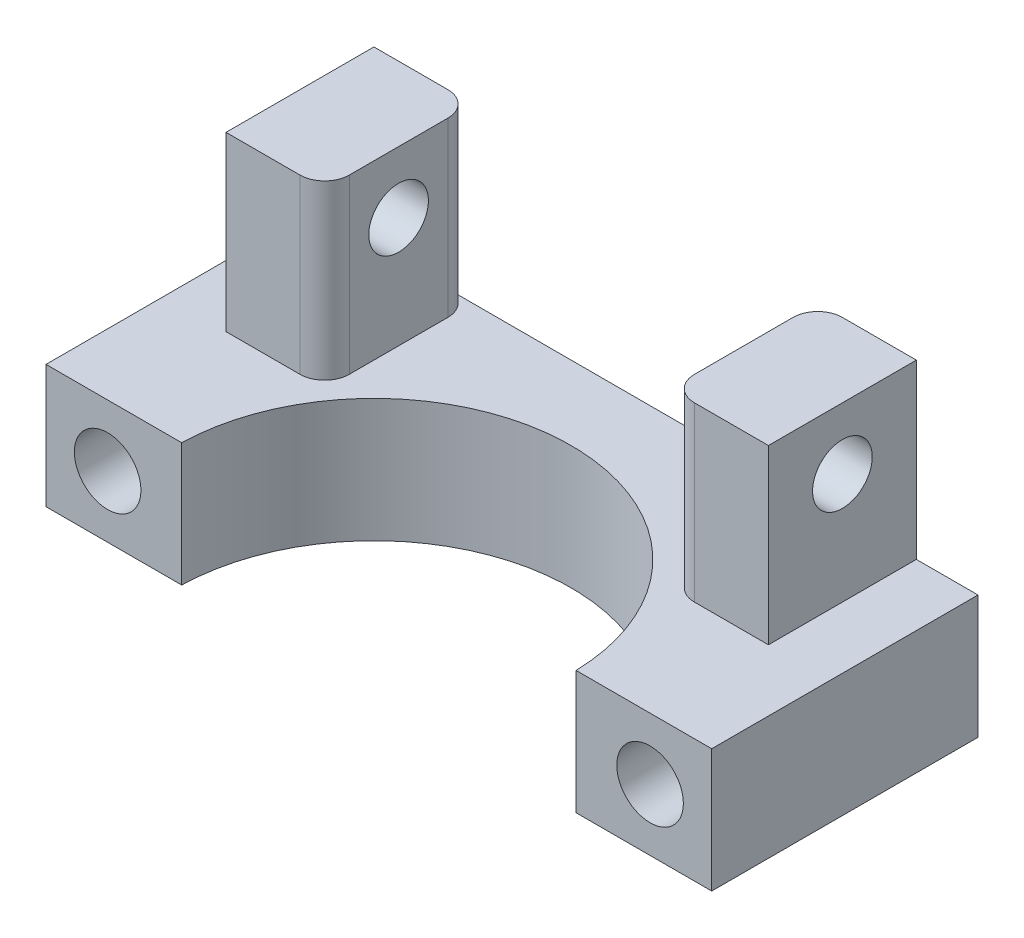
ISO-10303-21;
HEADER;
FILE_DESCRIPTION(('STEP AP214'),'2;1');
FILE_NAME('part.step','',(''),(''),'','','');
FILE_SCHEMA(('AUTOMOTIVE_DESIGN { 1 0 10303 214 1 1 1 1 }'));
ENDSEC;
DATA;
#1=APPLICATION_CONTEXT('core data for automotive mechanical design processes');
#2=APPLICATION_PROTOCOL_DEFINITION('international standard','automotive_design',2000,#1);
#3=PRODUCT_CONTEXT('',#1,'mechanical');
#4=PRODUCT('Part','Part','',(#3));
#5=PRODUCT_RELATED_PRODUCT_CATEGORY('part','',(#4));
#6=PRODUCT_DEFINITION_FORMATION('','',#4);
#7=PRODUCT_DEFINITION_CONTEXT('part definition',#1,'design');
#8=PRODUCT_DEFINITION('design','',#6,#7);
#9=PRODUCT_DEFINITION_SHAPE('','',#8);
#10=(LENGTH_UNIT() NAMED_UNIT(*) SI_UNIT(.MILLI.,.METRE.));
#11=(NAMED_UNIT(*) PLANE_ANGLE_UNIT() SI_UNIT($,.RADIAN.));
#12=(NAMED_UNIT(*) SI_UNIT($,.STERADIAN.) SOLID_ANGLE_UNIT());
#13=UNCERTAINTY_MEASURE_WITH_UNIT(LENGTH_MEASURE(1.E-05),#10,'distance_accuracy_value','');
#14=(GEOMETRIC_REPRESENTATION_CONTEXT(3) GLOBAL_UNCERTAINTY_ASSIGNED_CONTEXT((#13)) GLOBAL_UNIT_ASSIGNED_CONTEXT((#10,
#11,#12)) REPRESENTATION_CONTEXT('',''));
#15=CARTESIAN_POINT('',(0.,0.,0.));
#16=DIRECTION('',(0.,0.,1.));
#17=DIRECTION('',(1.,0.,0.));
#18=AXIS2_PLACEMENT_3D('',#15,#16,#17);
#19=CARTESIAN_POINT('',(11.,9.5,-8.00000011920929));
#20=DIRECTION('',(-1.,0.,0.));
#21=DIRECTION('',(0.,0.,1.));
#22=AXIS2_PLACEMENT_3D('',#19,#20,#21);
#23=CYLINDRICAL_SURFACE('',#22,1.21);
#24=CARTESIAN_POINT('',(11.,9.5,-8.00000011920929));
#25=DIRECTION('',(-1.,0.,0.));
#26=DIRECTION('',(0.,0.,1.));
#27=AXIS2_PLACEMENT_3D('',#24,#25,#26);
#28=CIRCLE('',#27,1.21);
#29=CARTESIAN_POINT('',(11.,9.5,-6.79000011920929));
#30=VERTEX_POINT('',#29);
#31=EDGE_CURVE('E265',#30,#30,#28,.T.);
#32=ORIENTED_EDGE('',*,*,#31,.F.);
#33=EDGE_LOOP('',(#32));
#34=FACE_BOUND('',#33,.T.);
#35=CARTESIAN_POINT('',(7.,9.5,-8.00000011920929));
#36=DIRECTION('',(1.,0.,0.));
#37=DIRECTION('',(0.,0.,1.));
#38=AXIS2_PLACEMENT_3D('',#35,#36,#37);
#39=CIRCLE('',#38,1.21);
#40=CARTESIAN_POINT('',(7.,9.5,-6.79000011920929));
#41=VERTEX_POINT('',#40);
#42=EDGE_CURVE('E282',#41,#41,#39,.T.);
#43=ORIENTED_EDGE('',*,*,#42,.F.);
#44=EDGE_LOOP('',(#43));
#45=FACE_BOUND('',#44,.T.);
#46=ADVANCED_FACE('F15',(#34,#45),#23,.F.);
#47=CARTESIAN_POINT('',(11.,9.5,-8.00000011920929));
#48=DIRECTION('',(-1.,0.,0.));
#49=DIRECTION('',(0.,0.,1.));
#50=AXIS2_PLACEMENT_3D('',#47,#48,#49);
#51=CYLINDRICAL_SURFACE('',#50,1.21);
#52=CARTESIAN_POINT('',(-11.,9.5,-8.00000011920929));
#53=DIRECTION('',(1.,0.,0.));
#54=DIRECTION('',(0.,1.,0.));
#55=AXIS2_PLACEMENT_3D('',#52,#53,#54);
#56=CIRCLE('',#55,1.21);
#57=CARTESIAN_POINT('',(-11.,10.71,-8.00000011920929));
#58=VERTEX_POINT('',#57);
#59=EDGE_CURVE('E25',#58,#58,#56,.T.);
#60=ORIENTED_EDGE('',*,*,#59,.F.);
#61=EDGE_LOOP('',(#60));
#62=FACE_BOUND('',#61,.T.);
#63=CARTESIAN_POINT('',(-7.00000000000001,9.5,-8.00000011920929));
#64=DIRECTION('',(-1.,0.,0.));
#65=DIRECTION('',(0.,0.,1.));
#66=AXIS2_PLACEMENT_3D('',#63,#64,#65);
#67=CIRCLE('',#66,1.21);
#68=CARTESIAN_POINT('',(-7.00000000000001,9.5,-6.79000011920929));
#69=VERTEX_POINT('',#68);
#70=EDGE_CURVE('E206',#69,#69,#67,.T.);
#71=ORIENTED_EDGE('',*,*,#70,.F.);
#72=EDGE_LOOP('',(#71));
#73=FACE_BOUND('',#72,.T.);
#74=ADVANCED_FACE('F329',(#62,#73),#51,.F.);
#75=CARTESIAN_POINT('',(-11.,5.,-5.));
#76=DIRECTION('',(0.,0.,1.));
#77=DIRECTION('',(1.,0.,0.));
#78=AXIS2_PLACEMENT_3D('',#75,#76,#77);
#79=PLANE('',#78);
#80=DIRECTION('',(-1.,0.,0.));
#81=VECTOR('',#80,1.);
#82=CARTESIAN_POINT('',(-5.5,5.,-5.));
#83=LINE('',#82,#81);
#84=CARTESIAN_POINT('',(-8.00000000000001,5.,-5.));
#85=VERTEX_POINT('',#84);
#86=CARTESIAN_POINT('',(-11.,5.,-5.));
#87=VERTEX_POINT('',#86);
#88=EDGE_CURVE('E33',#85,#87,#83,.T.);
#89=ORIENTED_EDGE('',*,*,#88,.F.);
#90=DIRECTION('',(0.,1.,0.));
#91=VECTOR('',#90,1.);
#92=CARTESIAN_POINT('',(-8.00000000000001,5.,-5.));
#93=LINE('',#92,#91);
#94=CARTESIAN_POINT('',(-8.00000000000001,12.,-5.));
#95=VERTEX_POINT('',#94);
#96=EDGE_CURVE('E9',#85,#95,#93,.T.);
#97=ORIENTED_EDGE('',*,*,#96,.T.);
#98=DIRECTION('',(1.,0.,0.));
#99=VECTOR('',#98,1.);
#100=CARTESIAN_POINT('',(-8.00000000000001,12.,-5.));
#101=LINE('',#100,#99);
#102=CARTESIAN_POINT('',(-11.,12.,-5.));
#103=VERTEX_POINT('',#102);
#104=EDGE_CURVE('E200',#103,#95,#101,.T.);
#105=ORIENTED_EDGE('',*,*,#104,.F.);
#106=DIRECTION('',(0.,1.,0.));
#107=VECTOR('',#106,1.);
#108=CARTESIAN_POINT('',(-11.,5.,-5.));
#109=LINE('',#108,#107);
#110=EDGE_CURVE('E205',#87,#103,#109,.T.);
#111=ORIENTED_EDGE('',*,*,#110,.F.);
#112=EDGE_LOOP('',(#89,#97,#105,#111));
#113=FACE_BOUND('',#112,.T.);
#114=ADVANCED_FACE('F335',(#113),#79,.T.);
#115=CARTESIAN_POINT('',(-11.,5.,-11.));
#116=DIRECTION('',(-1.,0.,0.));
#117=DIRECTION('',(0.,0.,1.));
#118=AXIS2_PLACEMENT_3D('',#115,#116,#117);
#119=PLANE('',#118);
#120=ORIENTED_EDGE('',*,*,#59,.T.);
#121=EDGE_LOOP('',(#120));
#122=FACE_BOUND('',#121,.T.);
#123=DIRECTION('',(0.,0.,-1.));
#124=VECTOR('',#123,1.);
#125=CARTESIAN_POINT('',(-11.,5.,-8.3));
#126=LINE('',#125,#124);
#127=CARTESIAN_POINT('',(-11.,5.,-11.));
#128=VERTEX_POINT('',#127);
#129=EDGE_CURVE('E231',#87,#128,#126,.T.);
#130=ORIENTED_EDGE('',*,*,#129,.F.);
#131=ORIENTED_EDGE('',*,*,#110,.T.);
#132=DIRECTION('',(0.,0.,1.));
#133=VECTOR('',#132,1.);
#134=CARTESIAN_POINT('',(-11.,12.,-5.));
#135=LINE('',#134,#133);
#136=CARTESIAN_POINT('',(-11.,12.,-11.));
#137=VERTEX_POINT('',#136);
#138=EDGE_CURVE('E196',#137,#103,#135,.T.);
#139=ORIENTED_EDGE('',*,*,#138,.F.);
#140=DIRECTION('',(0.,1.,0.));
#141=VECTOR('',#140,1.);
#142=CARTESIAN_POINT('',(-11.,5.,-11.));
#143=LINE('',#142,#141);
#144=EDGE_CURVE('E187',#128,#137,#143,.T.);
#145=ORIENTED_EDGE('',*,*,#144,.F.);
#146=EDGE_LOOP('',(#130,#131,#139,#145));
#147=FACE_BOUND('',#146,.T.);
#148=ADVANCED_FACE('F359',(#122,#147),#119,.T.);
#149=CARTESIAN_POINT('',(-8.00000000000001,5.,-10.));
#150=DIRECTION('',(0.,1.,0.));
#151=DIRECTION('',(1.,0.,0.));
#152=AXIS2_PLACEMENT_3D('',#149,#150,#151);
#153=CYLINDRICAL_SURFACE('',#152,1.);
#154=CARTESIAN_POINT('',(-8.00000000000001,5.,-10.));
#155=DIRECTION('',(0.,-1.,0.));
#156=DIRECTION('',(0.,0.,-1.));
#157=AXIS2_PLACEMENT_3D('',#154,#155,#156);
#158=CIRCLE('',#157,1.);
#159=CARTESIAN_POINT('',(-8.00000000000001,5.,-11.));
#160=VERTEX_POINT('',#159);
#161=CARTESIAN_POINT('',(-7.00000000000001,5.,-10.));
#162=VERTEX_POINT('',#161);
#163=EDGE_CURVE('E198',#160,#162,#158,.T.);
#164=ORIENTED_EDGE('',*,*,#163,.F.);
#165=DIRECTION('',(0.,1.,0.));
#166=VECTOR('',#165,1.);
#167=CARTESIAN_POINT('',(-8.00000000000001,5.,-11.));
#168=LINE('',#167,#166);
#169=CARTESIAN_POINT('',(-8.00000000000001,12.,-11.));
#170=VERTEX_POINT('',#169);
#171=EDGE_CURVE('E202',#160,#170,#168,.T.);
#172=ORIENTED_EDGE('',*,*,#171,.T.);
#173=CARTESIAN_POINT('',(-8.00000000000001,12.,-10.));
#174=DIRECTION('',(0.,1.,0.));
#175=DIRECTION('',(1.,0.,0.));
#176=AXIS2_PLACEMENT_3D('',#173,#174,#175);
#177=CIRCLE('',#176,1.);
#178=CARTESIAN_POINT('',(-7.00000000000001,12.,-10.));
#179=VERTEX_POINT('',#178);
#180=EDGE_CURVE('E207',#179,#170,#177,.T.);
#181=ORIENTED_EDGE('',*,*,#180,.F.);
#182=DIRECTION('',(0.,1.,0.));
#183=VECTOR('',#182,1.);
#184=CARTESIAN_POINT('',(-7.00000000000001,5.,-10.));
#185=LINE('',#184,#183);
#186=EDGE_CURVE('E211',#162,#179,#185,.T.);
#187=ORIENTED_EDGE('',*,*,#186,.F.);
#188=EDGE_LOOP('',(#164,#172,#181,#187));
#189=FACE_BOUND('',#188,.T.);
#190=ADVANCED_FACE('F357',(#189),#153,.T.);
#191=CARTESIAN_POINT('',(-7.00000000000001,5.,-6.));
#192=DIRECTION('',(1.,0.,0.));
#193=DIRECTION('',(0.,0.,-1.));
#194=AXIS2_PLACEMENT_3D('',#191,#192,#193);
#195=PLANE('',#194);
#196=ORIENTED_EDGE('',*,*,#70,.T.);
#197=EDGE_LOOP('',(#196));
#198=FACE_BOUND('',#197,.T.);
#199=DIRECTION('',(0.,0.,1.));
#200=VECTOR('',#199,1.);
#201=CARTESIAN_POINT('',(-7.00000000000001,5.,-5.8));
#202=LINE('',#201,#200);
#203=CARTESIAN_POINT('',(-7.00000000000001,5.,-6.));
#204=VERTEX_POINT('',#203);
#205=EDGE_CURVE('E201',#162,#204,#202,.T.);
#206=ORIENTED_EDGE('',*,*,#205,.F.);
#207=ORIENTED_EDGE('',*,*,#186,.T.);
#208=DIRECTION('',(0.,0.,-1.));
#209=VECTOR('',#208,1.);
#210=CARTESIAN_POINT('',(-7.00000000000001,12.,-10.));
#211=LINE('',#210,#209);
#212=CARTESIAN_POINT('',(-7.00000000000001,12.,-6.));
#213=VERTEX_POINT('',#212);
#214=EDGE_CURVE('E209',#213,#179,#211,.T.);
#215=ORIENTED_EDGE('',*,*,#214,.F.);
#216=DIRECTION('',(0.,1.,0.));
#217=VECTOR('',#216,1.);
#218=CARTESIAN_POINT('',(-7.00000000000001,5.,-6.));
#219=LINE('',#218,#217);
#220=EDGE_CURVE('E214',#204,#213,#219,.T.);
#221=ORIENTED_EDGE('',*,*,#220,.F.);
#222=EDGE_LOOP('',(#206,#207,#215,#221));
#223=FACE_BOUND('',#222,.T.);
#224=ADVANCED_FACE('F346',(#198,#223),#195,.T.);
#225=CARTESIAN_POINT('',(-8.00000000000001,5.,-6.));
#226=DIRECTION('',(0.,1.,0.));
#227=DIRECTION('',(1.,0.,0.));
#228=AXIS2_PLACEMENT_3D('',#225,#226,#227);
#229=CYLINDRICAL_SURFACE('',#228,1.);
#230=CARTESIAN_POINT('',(-8.00000000000001,5.,-6.));
#231=DIRECTION('',(0.,-1.,0.));
#232=DIRECTION('',(0.,0.,-1.));
#233=AXIS2_PLACEMENT_3D('',#230,#231,#232);
#234=CIRCLE('',#233,1.);
#235=EDGE_CURVE('E216',#204,#85,#234,.T.);
#236=ORIENTED_EDGE('',*,*,#235,.F.);
#237=ORIENTED_EDGE('',*,*,#220,.T.);
#238=CARTESIAN_POINT('',(-8.00000000000001,12.,-6.));
#239=DIRECTION('',(0.,1.,0.));
#240=DIRECTION('',(1.,0.,0.));
#241=AXIS2_PLACEMENT_3D('',#238,#239,#240);
#242=CIRCLE('',#241,1.);
#243=EDGE_CURVE('E219',#95,#213,#242,.T.);
#244=ORIENTED_EDGE('',*,*,#243,.F.);
#245=ORIENTED_EDGE('',*,*,#96,.F.);
#246=EDGE_LOOP('',(#236,#237,#244,#245));
#247=FACE_BOUND('',#246,.T.);
#248=ADVANCED_FACE('F342',(#247),#229,.T.);
#249=CARTESIAN_POINT('',(-9.00000000000001,12.,-8.));
#250=DIRECTION('',(0.,1.,0.));
#251=DIRECTION('',(0.,0.,1.));
#252=AXIS2_PLACEMENT_3D('',#249,#250,#251);
#253=PLANE('',#252);
#254=ORIENTED_EDGE('',*,*,#243,.T.);
#255=ORIENTED_EDGE('',*,*,#214,.T.);
#256=ORIENTED_EDGE('',*,*,#180,.T.);
#257=DIRECTION('',(-1.,0.,0.));
#258=VECTOR('',#257,1.);
#259=CARTESIAN_POINT('',(-11.,12.,-11.));
#260=LINE('',#259,#258);
#261=EDGE_CURVE('E210',#170,#137,#260,.T.);
#262=ORIENTED_EDGE('',*,*,#261,.T.);
#263=ORIENTED_EDGE('',*,*,#138,.T.);
#264=ORIENTED_EDGE('',*,*,#104,.T.);
#265=EDGE_LOOP('',(#254,#255,#256,#262,#263,#264));
#266=FACE_BOUND('',#265,.T.);
#267=ADVANCED_FACE('F345',(#266),#253,.T.);
#268=CARTESIAN_POINT('',(0.,5.,-5.59999999999999));
#269=DIRECTION('',(0.,1.,0.));
#270=DIRECTION('',(0.,0.,1.));
#271=AXIS2_PLACEMENT_3D('',#268,#269,#270);
#272=PLANE('',#271);
#273=ORIENTED_EDGE('',*,*,#163,.T.);
#274=ORIENTED_EDGE('',*,*,#205,.T.);
#275=ORIENTED_EDGE('',*,*,#235,.T.);
#276=ORIENTED_EDGE('',*,*,#88,.T.);
#277=ORIENTED_EDGE('',*,*,#129,.T.);
#278=DIRECTION('',(-1.,0.,0.));
#279=VECTOR('',#278,1.);
#280=CARTESIAN_POINT('',(-13.5,5.,-11.));
#281=LINE('',#280,#279);
#282=CARTESIAN_POINT('',(-13.5,5.,-11.));
#283=VERTEX_POINT('',#282);
#284=EDGE_CURVE('E228',#128,#283,#281,.T.);
#285=ORIENTED_EDGE('',*,*,#284,.T.);
#286=DIRECTION('',(0.,0.,1.));
#287=VECTOR('',#286,1.);
#288=CARTESIAN_POINT('',(-13.5,5.,-0.19999999999997));
#289=LINE('',#288,#287);
#290=CARTESIAN_POINT('',(-13.5,5.,-0.199999999999969));
#291=VERTEX_POINT('',#290);
#292=EDGE_CURVE('E232',#283,#291,#289,.T.);
#293=ORIENTED_EDGE('',*,*,#292,.T.);
#294=DIRECTION('',(1.,0.,0.));
#295=VECTOR('',#294,1.);
#296=CARTESIAN_POINT('',(-7.99749960925363,5.,-0.199999999999989));
#297=LINE('',#296,#295);
#298=CARTESIAN_POINT('',(-7.99749960925363,5.,-0.199999999999989));
#299=VERTEX_POINT('',#298);
#300=EDGE_CURVE('E235',#291,#299,#297,.T.);
#301=ORIENTED_EDGE('',*,*,#300,.T.);
#302=CARTESIAN_POINT('',(0.,5.,0.));
#303=DIRECTION('',(0.,-1.,0.));
#304=DIRECTION('',(0.,0.,-1.));
#305=AXIS2_PLACEMENT_3D('',#302,#303,#304);
#306=CIRCLE('',#305,8.);
#307=CARTESIAN_POINT('',(7.99749960925288,5.,-0.199999999999996));
#308=VERTEX_POINT('',#307);
#309=EDGE_CURVE('E238',#299,#308,#306,.T.);
#310=ORIENTED_EDGE('',*,*,#309,.T.);
#311=DIRECTION('',(1.,0.,0.));
#312=VECTOR('',#311,1.);
#313=CARTESIAN_POINT('',(13.5,5.,-0.199999999999998));
#314=LINE('',#313,#312);
#315=CARTESIAN_POINT('',(13.5,5.,-0.199999999999998));
#316=VERTEX_POINT('',#315);
#317=EDGE_CURVE('E241',#308,#316,#314,.T.);
#318=ORIENTED_EDGE('',*,*,#317,.T.);
#319=DIRECTION('',(0.,0.,-1.));
#320=VECTOR('',#319,1.);
#321=CARTESIAN_POINT('',(13.5,5.,-11.));
#322=LINE('',#321,#320);
#323=CARTESIAN_POINT('',(13.5,5.,-11.));
#324=VERTEX_POINT('',#323);
#325=EDGE_CURVE('E244',#316,#324,#322,.T.);
#326=ORIENTED_EDGE('',*,*,#325,.T.);
#327=DIRECTION('',(-1.,0.,0.));
#328=VECTOR('',#327,1.);
#329=CARTESIAN_POINT('',(-13.5,5.,-11.));
#330=LINE('',#329,#328);
#331=CARTESIAN_POINT('',(11.,5.,-11.));
#332=VERTEX_POINT('',#331);
#333=EDGE_CURVE('E153',#324,#332,#330,.T.);
#334=ORIENTED_EDGE('',*,*,#333,.T.);
#335=DIRECTION('',(0.,0.,1.));
#336=VECTOR('',#335,1.);
#337=CARTESIAN_POINT('',(11.,5.,-5.3));
#338=LINE('',#337,#336);
#339=CARTESIAN_POINT('',(11.,5.,-5.00000000000001));
#340=VERTEX_POINT('',#339);
#341=EDGE_CURVE('E247',#332,#340,#338,.T.);
#342=ORIENTED_EDGE('',*,*,#341,.T.);
#343=DIRECTION('',(-1.,0.,0.));
#344=VECTOR('',#343,1.);
#345=CARTESIAN_POINT('',(4.,5.,-5.));
#346=LINE('',#345,#344);
#347=CARTESIAN_POINT('',(8.,5.,-5.00000000000001));
#348=VERTEX_POINT('',#347);
#349=EDGE_CURVE('E250',#340,#348,#346,.T.);
#350=ORIENTED_EDGE('',*,*,#349,.T.);
#351=CARTESIAN_POINT('',(8.,5.,-6.00000000000001));
#352=DIRECTION('',(0.,-1.,0.));
#353=DIRECTION('',(0.,0.,-1.));
#354=AXIS2_PLACEMENT_3D('',#351,#352,#353);
#355=CIRCLE('',#354,1.);
#356=CARTESIAN_POINT('',(7.,5.,-6.00000000000001));
#357=VERTEX_POINT('',#356);
#358=EDGE_CURVE('E253',#348,#357,#355,.T.);
#359=ORIENTED_EDGE('',*,*,#358,.T.);
#360=DIRECTION('',(0.,0.,-1.));
#361=VECTOR('',#360,1.);
#362=CARTESIAN_POINT('',(7.,5.,-7.8));
#363=LINE('',#362,#361);
#364=CARTESIAN_POINT('',(7.,5.,-10.));
#365=VERTEX_POINT('',#364);
#366=EDGE_CURVE('E256',#357,#365,#363,.T.);
#367=ORIENTED_EDGE('',*,*,#366,.T.);
#368=CARTESIAN_POINT('',(8.,5.,-10.));
#369=DIRECTION('',(0.,-1.,0.));
#370=DIRECTION('',(0.,0.,-1.));
#371=AXIS2_PLACEMENT_3D('',#368,#369,#370);
#372=CIRCLE('',#371,0.999999999999999);
#373=CARTESIAN_POINT('',(8.,5.,-11.));
#374=VERTEX_POINT('',#373);
#375=EDGE_CURVE('E259',#365,#374,#372,.T.);
#376=ORIENTED_EDGE('',*,*,#375,.T.);
#377=DIRECTION('',(-1.,0.,0.));
#378=VECTOR('',#377,1.);
#379=CARTESIAN_POINT('',(-13.5,5.,-11.));
#380=LINE('',#379,#378);
#381=EDGE_CURVE('E262',#374,#160,#380,.T.);
#382=ORIENTED_EDGE('',*,*,#381,.T.);
#383=EDGE_LOOP('',(#273,#274,#275,#276,#277,#285,#293,#301,#310,#318,#326,#334,#342,#350,#359,
#367,#376,#382));
#384=FACE_BOUND('',#383,.T.);
#385=ADVANCED_FACE('F377',(#384),#272,.T.);
#386=CARTESIAN_POINT('',(11.,5.,-5.00000000000001));
#387=DIRECTION('',(1.,0.,0.));
#388=DIRECTION('',(0.,0.,-1.));
#389=AXIS2_PLACEMENT_3D('',#386,#387,#388);
#390=PLANE('',#389);
#391=ORIENTED_EDGE('',*,*,#31,.T.);
#392=EDGE_LOOP('',(#391));
#393=FACE_BOUND('',#392,.T.);
#394=ORIENTED_EDGE('',*,*,#341,.F.);
#395=DIRECTION('',(0.,1.,0.));
#396=VECTOR('',#395,1.);
#397=CARTESIAN_POINT('',(11.,5.,-11.));
#398=LINE('',#397,#396);
#399=CARTESIAN_POINT('',(11.,12.,-11.));
#400=VERTEX_POINT('',#399);
#401=EDGE_CURVE('E266',#332,#400,#398,.T.);
#402=ORIENTED_EDGE('',*,*,#401,.T.);
#403=DIRECTION('',(0.,0.,-1.));
#404=VECTOR('',#403,1.);
#405=CARTESIAN_POINT('',(11.,12.,-5.00000000000001));
#406=LINE('',#405,#404);
#407=CARTESIAN_POINT('',(11.,12.,-5.00000000000001));
#408=VERTEX_POINT('',#407);
#409=EDGE_CURVE('E270',#408,#400,#406,.T.);
#410=ORIENTED_EDGE('',*,*,#409,.F.);
#411=DIRECTION('',(0.,1.,0.));
#412=VECTOR('',#411,1.);
#413=CARTESIAN_POINT('',(11.,5.,-5.00000000000001));
#414=LINE('',#413,#412);
#415=EDGE_CURVE('E269',#340,#408,#414,.T.);
#416=ORIENTED_EDGE('',*,*,#415,.F.);
#417=EDGE_LOOP('',(#394,#402,#410,#416));
#418=FACE_BOUND('',#417,.T.);
#419=ADVANCED_FACE('F371',(#393,#418),#390,.T.);
#420=CARTESIAN_POINT('',(8.,5.,-5.00000000000001));
#421=DIRECTION('',(0.,0.,1.));
#422=DIRECTION('',(1.,0.,0.));
#423=AXIS2_PLACEMENT_3D('',#420,#421,#422);
#424=PLANE('',#423);
#425=ORIENTED_EDGE('',*,*,#349,.F.);
#426=ORIENTED_EDGE('',*,*,#415,.T.);
#427=DIRECTION('',(1.,0.,0.));
#428=VECTOR('',#427,1.);
#429=CARTESIAN_POINT('',(8.,12.,-5.00000000000001));
#430=LINE('',#429,#428);
#431=CARTESIAN_POINT('',(8.,12.,-5.00000000000001));
#432=VERTEX_POINT('',#431);
#433=EDGE_CURVE('E272',#432,#408,#430,.T.);
#434=ORIENTED_EDGE('',*,*,#433,.F.);
#435=DIRECTION('',(0.,1.,0.));
#436=VECTOR('',#435,1.);
#437=CARTESIAN_POINT('',(8.,5.,-5.00000000000001));
#438=LINE('',#437,#436);
#439=EDGE_CURVE('E276',#348,#432,#438,.T.);
#440=ORIENTED_EDGE('',*,*,#439,.F.);
#441=EDGE_LOOP('',(#425,#426,#434,#440));
#442=FACE_BOUND('',#441,.T.);
#443=ADVANCED_FACE('F363',(#442),#424,.T.);
#444=CARTESIAN_POINT('',(8.,5.,-6.00000000000001));
#445=DIRECTION('',(0.,1.,0.));
#446=DIRECTION('',(1.,0.,0.));
#447=AXIS2_PLACEMENT_3D('',#444,#445,#446);
#448=CYLINDRICAL_SURFACE('',#447,1.);
#449=ORIENTED_EDGE('',*,*,#358,.F.);
#450=ORIENTED_EDGE('',*,*,#439,.T.);
#451=CARTESIAN_POINT('',(8.,12.,-6.00000000000001));
#452=DIRECTION('',(0.,1.,0.));
#453=DIRECTION('',(1.,0.,0.));
#454=AXIS2_PLACEMENT_3D('',#451,#452,#453);
#455=CIRCLE('',#454,1.);
#456=CARTESIAN_POINT('',(7.,12.,-6.00000000000001));
#457=VERTEX_POINT('',#456);
#458=EDGE_CURVE('E279',#457,#432,#455,.T.);
#459=ORIENTED_EDGE('',*,*,#458,.F.);
#460=DIRECTION('',(0.,1.,0.));
#461=VECTOR('',#460,1.);
#462=CARTESIAN_POINT('',(7.,5.,-6.00000000000001));
#463=LINE('',#462,#461);
#464=EDGE_CURVE('E286',#357,#457,#463,.T.);
#465=ORIENTED_EDGE('',*,*,#464,.F.);
#466=EDGE_LOOP('',(#449,#450,#459,#465));
#467=FACE_BOUND('',#466,.T.);
#468=ADVANCED_FACE('F361',(#467),#448,.T.);
#469=CARTESIAN_POINT('',(7.,5.,-10.));
#470=DIRECTION('',(-1.,0.,0.));
#471=DIRECTION('',(0.,0.,1.));
#472=AXIS2_PLACEMENT_3D('',#469,#470,#471);
#473=PLANE('',#472);
#474=ORIENTED_EDGE('',*,*,#42,.T.);
#475=EDGE_LOOP('',(#474));
#476=FACE_BOUND('',#475,.T.);
#477=ORIENTED_EDGE('',*,*,#366,.F.);
#478=ORIENTED_EDGE('',*,*,#464,.T.);
#479=DIRECTION('',(0.,0.,1.));
#480=VECTOR('',#479,1.);
#481=CARTESIAN_POINT('',(7.,12.,-10.));
#482=LINE('',#481,#480);
#483=CARTESIAN_POINT('',(7.,12.,-10.));
#484=VERTEX_POINT('',#483);
#485=EDGE_CURVE('E285',#484,#457,#482,.T.);
#486=ORIENTED_EDGE('',*,*,#485,.F.);
#487=DIRECTION('',(0.,1.,0.));
#488=VECTOR('',#487,1.);
#489=CARTESIAN_POINT('',(7.,5.,-10.));
#490=LINE('',#489,#488);
#491=EDGE_CURVE('E289',#365,#484,#490,.T.);
#492=ORIENTED_EDGE('',*,*,#491,.F.);
#493=EDGE_LOOP('',(#477,#478,#486,#492));
#494=FACE_BOUND('',#493,.T.);
#495=ADVANCED_FACE('F351',(#476,#494),#473,.T.);
#496=CARTESIAN_POINT('',(8.,5.,-10.));
#497=DIRECTION('',(0.,1.,0.));
#498=DIRECTION('',(1.,0.,0.));
#499=AXIS2_PLACEMENT_3D('',#496,#497,#498);
#500=CYLINDRICAL_SURFACE('',#499,0.999999999999999);
#501=ORIENTED_EDGE('',*,*,#375,.F.);
#502=ORIENTED_EDGE('',*,*,#491,.T.);
#503=CARTESIAN_POINT('',(8.,12.,-10.));
#504=DIRECTION('',(0.,1.,0.));
#505=DIRECTION('',(1.,0.,0.));
#506=AXIS2_PLACEMENT_3D('',#503,#504,#505);
#507=CIRCLE('',#506,0.999999999999999);
#508=CARTESIAN_POINT('',(8.,12.,-11.));
#509=VERTEX_POINT('',#508);
#510=EDGE_CURVE('E292',#509,#484,#507,.T.);
#511=ORIENTED_EDGE('',*,*,#510,.F.);
#512=DIRECTION('',(0.,1.,0.));
#513=VECTOR('',#512,1.);
#514=CARTESIAN_POINT('',(8.,5.,-11.));
#515=LINE('',#514,#513);
#516=EDGE_CURVE('E156',#374,#509,#515,.T.);
#517=ORIENTED_EDGE('',*,*,#516,.F.);
#518=EDGE_LOOP('',(#501,#502,#511,#517));
#519=FACE_BOUND('',#518,.T.);
#520=ADVANCED_FACE('F348',(#519),#500,.T.);
#521=CARTESIAN_POINT('',(9.,12.,-8.00000000000001));
#522=DIRECTION('',(0.,1.,0.));
#523=DIRECTION('',(0.,0.,1.));
#524=AXIS2_PLACEMENT_3D('',#521,#522,#523);
#525=PLANE('',#524);
#526=ORIENTED_EDGE('',*,*,#510,.T.);
#527=ORIENTED_EDGE('',*,*,#485,.T.);
#528=ORIENTED_EDGE('',*,*,#458,.T.);
#529=ORIENTED_EDGE('',*,*,#433,.T.);
#530=ORIENTED_EDGE('',*,*,#409,.T.);
#531=DIRECTION('',(-1.,0.,0.));
#532=VECTOR('',#531,1.);
#533=CARTESIAN_POINT('',(11.,12.,-11.));
#534=LINE('',#533,#532);
#535=EDGE_CURVE('E273',#400,#509,#534,.T.);
#536=ORIENTED_EDGE('',*,*,#535,.T.);
#537=EDGE_LOOP('',(#526,#527,#528,#529,#530,#536));
#538=FACE_BOUND('',#537,.T.);
#539=ADVANCED_FACE('F350',(#538),#525,.T.);
#540=CARTESIAN_POINT('',(-11.,2.5,-5.05999999999998));
#541=DIRECTION('',(0.,0.,1.));
#542=DIRECTION('',(1.,0.,0.));
#543=AXIS2_PLACEMENT_3D('',#540,#541,#542);
#544=CYLINDRICAL_SURFACE('',#543,1.35);
#545=CARTESIAN_POINT('',(-11.,2.5,-0.199999999999971));
#546=DIRECTION('',(0.,0.,-1.));
#547=DIRECTION('',(-1.,0.,0.));
#548=AXIS2_PLACEMENT_3D('',#545,#546,#547);
#549=CIRCLE('',#548,1.35);
#550=CARTESIAN_POINT('',(-12.35,2.5,-0.199999999999966));
#551=VERTEX_POINT('',#550);
#552=EDGE_CURVE('E175',#551,#551,#549,.T.);
#553=ORIENTED_EDGE('',*,*,#552,.F.);
#554=EDGE_LOOP('',(#553));
#555=FACE_BOUND('',#554,.T.);
#556=CARTESIAN_POINT('',(-11.,2.5,-11.));
#557=DIRECTION('',(0.,0.,1.));
#558=DIRECTION('',(1.,0.,0.));
#559=AXIS2_PLACEMENT_3D('',#556,#557,#558);
#560=CIRCLE('',#559,1.35);
#561=CARTESIAN_POINT('',(-9.65000000000001,2.5,-11.));
#562=VERTEX_POINT('',#561);
#563=EDGE_CURVE('E184',#562,#562,#560,.T.);
#564=ORIENTED_EDGE('',*,*,#563,.F.);
#565=EDGE_LOOP('',(#564));
#566=FACE_BOUND('',#565,.T.);
#567=ADVANCED_FACE('F311',(#555,#566),#544,.F.);
#568=CARTESIAN_POINT('',(11.,2.5,-5.05999999999999));
#569=DIRECTION('',(0.,0.,1.));
#570=DIRECTION('',(1.,0.,0.));
#571=AXIS2_PLACEMENT_3D('',#568,#569,#570);
#572=CYLINDRICAL_SURFACE('',#571,1.35);
#573=CARTESIAN_POINT('',(11.,2.5,-0.199999999999997));
#574=DIRECTION('',(0.,0.,-1.));
#575=DIRECTION('',(-1.,0.,0.));
#576=AXIS2_PLACEMENT_3D('',#573,#574,#575);
#577=CIRCLE('',#576,1.35);
#578=CARTESIAN_POINT('',(9.65,2.5,-0.199999999999997));
#579=VERTEX_POINT('',#578);
#580=EDGE_CURVE('E172',#579,#579,#577,.T.);
#581=ORIENTED_EDGE('',*,*,#580,.F.);
#582=EDGE_LOOP('',(#581));
#583=FACE_BOUND('',#582,.T.);
#584=CARTESIAN_POINT('',(11.,2.5,-11.));
#585=DIRECTION('',(0.,0.,1.));
#586=DIRECTION('',(1.,0.,0.));
#587=AXIS2_PLACEMENT_3D('',#584,#585,#586);
#588=CIRCLE('',#587,1.35);
#589=CARTESIAN_POINT('',(12.35,2.5,-11.));
#590=VERTEX_POINT('',#589);
#591=EDGE_CURVE('E169',#590,#590,#588,.T.);
#592=ORIENTED_EDGE('',*,*,#591,.F.);
#593=EDGE_LOOP('',(#592));
#594=FACE_BOUND('',#593,.T.);
#595=ADVANCED_FACE('F308',(#583,#594),#572,.F.);
#596=CARTESIAN_POINT('',(7.99749960925288,0.,-0.199999999999996));
#597=DIRECTION('',(0.,0.,1.));
#598=DIRECTION('',(1.,0.,0.));
#599=AXIS2_PLACEMENT_3D('',#596,#597,#598);
#600=PLANE('',#599);
#601=ORIENTED_EDGE('',*,*,#580,.T.);
#602=EDGE_LOOP('',(#601));
#603=FACE_BOUND('',#602,.T.);
#604=DIRECTION('',(-1.,0.,0.));
#605=VECTOR('',#604,1.);
#606=CARTESIAN_POINT('',(13.5,0.,-0.199999999999998));
#607=LINE('',#606,#605);
#608=CARTESIAN_POINT('',(13.5,0.,-0.199999999999998));
#609=VERTEX_POINT('',#608);
#610=CARTESIAN_POINT('',(7.99749960925288,0.,-0.199999999999996));
#611=VERTEX_POINT('',#610);
#612=EDGE_CURVE('E161',#609,#611,#607,.T.);
#613=ORIENTED_EDGE('',*,*,#612,.F.);
#614=DIRECTION('',(0.,1.,0.));
#615=VECTOR('',#614,1.);
#616=CARTESIAN_POINT('',(13.5,0.,-0.199999999999998));
#617=LINE('',#616,#615);
#618=EDGE_CURVE('E160',#609,#316,#617,.T.);
#619=ORIENTED_EDGE('',*,*,#618,.T.);
#620=ORIENTED_EDGE('',*,*,#317,.F.);
#621=DIRECTION('',(0.,1.,0.));
#622=VECTOR('',#621,1.);
#623=CARTESIAN_POINT('',(7.99749960925288,0.,-0.199999999999996));
#624=LINE('',#623,#622);
#625=EDGE_CURVE('E173',#611,#308,#624,.T.);
#626=ORIENTED_EDGE('',*,*,#625,.F.);
#627=EDGE_LOOP('',(#613,#619,#620,#626));
#628=FACE_BOUND('',#627,.T.);
#629=ADVANCED_FACE('F305',(#603,#628),#600,.T.);
#630=CARTESIAN_POINT('',(0.,0.,0.));
#631=DIRECTION('',(0.,1.,0.));
#632=DIRECTION('',(1.,0.,0.));
#633=AXIS2_PLACEMENT_3D('',#630,#631,#632);
#634=CYLINDRICAL_SURFACE('',#633,8.);
#635=CARTESIAN_POINT('',(0.,0.,0.));
#636=DIRECTION('',(0.,1.,0.));
#637=DIRECTION('',(1.,0.,0.));
#638=AXIS2_PLACEMENT_3D('',#635,#636,#637);
#639=CIRCLE('',#638,8.);
#640=CARTESIAN_POINT('',(-7.99749960925363,0.,-0.199999999999989));
#641=VERTEX_POINT('',#640);
#642=EDGE_CURVE('E162',#611,#641,#639,.T.);
#643=ORIENTED_EDGE('',*,*,#642,.F.);
#644=ORIENTED_EDGE('',*,*,#625,.T.);
#645=ORIENTED_EDGE('',*,*,#309,.F.);
#646=DIRECTION('',(0.,1.,0.));
#647=VECTOR('',#646,1.);
#648=CARTESIAN_POINT('',(-7.99749960925363,0.,-0.199999999999989));
#649=LINE('',#648,#647);
#650=EDGE_CURVE('E177',#641,#299,#649,.T.);
#651=ORIENTED_EDGE('',*,*,#650,.F.);
#652=EDGE_LOOP('',(#643,#644,#645,#651));
#653=FACE_BOUND('',#652,.T.);
#654=ADVANCED_FACE('F17',(#653),#634,.F.);
#655=CARTESIAN_POINT('',(-13.5,0.,-0.19999999999997));
#656=DIRECTION('',(0.,0.,1.));
#657=DIRECTION('',(1.,0.,0.));
#658=AXIS2_PLACEMENT_3D('',#655,#656,#657);
#659=PLANE('',#658);
#660=ORIENTED_EDGE('',*,*,#552,.T.);
#661=EDGE_LOOP('',(#660));
#662=FACE_BOUND('',#661,.T.);
#663=DIRECTION('',(-1.,0.,0.));
#664=VECTOR('',#663,1.);
#665=CARTESIAN_POINT('',(-7.99749960925363,0.,-0.199999999999989));
#666=LINE('',#665,#664);
#667=CARTESIAN_POINT('',(-13.5,0.,-0.19999999999997));
#668=VERTEX_POINT('',#667);
#669=EDGE_CURVE('E165',#641,#668,#666,.T.);
#670=ORIENTED_EDGE('',*,*,#669,.F.);
#671=ORIENTED_EDGE('',*,*,#650,.T.);
#672=ORIENTED_EDGE('',*,*,#300,.F.);
#673=DIRECTION('',(0.,1.,0.));
#674=VECTOR('',#673,1.);
#675=CARTESIAN_POINT('',(-13.5,0.,-0.19999999999997));
#676=LINE('',#675,#674);
#677=EDGE_CURVE('E180',#668,#291,#676,.T.);
#678=ORIENTED_EDGE('',*,*,#677,.F.);
#679=EDGE_LOOP('',(#670,#671,#672,#678));
#680=FACE_BOUND('',#679,.T.);
#681=ADVANCED_FACE('F325',(#662,#680),#659,.T.);
#682=CARTESIAN_POINT('',(-13.5,0.,-11.));
#683=DIRECTION('',(-1.,0.,0.));
#684=DIRECTION('',(0.,0.,1.));
#685=AXIS2_PLACEMENT_3D('',#682,#683,#684);
#686=PLANE('',#685);
#687=DIRECTION('',(0.,0.,-1.));
#688=VECTOR('',#687,1.);
#689=CARTESIAN_POINT('',(-13.5,0.,-0.19999999999997));
#690=LINE('',#689,#688);
#691=CARTESIAN_POINT('',(-13.5,0.,-11.));
#692=VERTEX_POINT('',#691);
#693=EDGE_CURVE('E137',#668,#692,#690,.T.);
#694=ORIENTED_EDGE('',*,*,#693,.F.);
#695=ORIENTED_EDGE('',*,*,#677,.T.);
#696=ORIENTED_EDGE('',*,*,#292,.F.);
#697=DIRECTION('',(0.,1.,0.));
#698=VECTOR('',#697,1.);
#699=CARTESIAN_POINT('',(-13.5,0.,-11.));
#700=LINE('',#699,#698);
#701=EDGE_CURVE('E186',#692,#283,#700,.T.);
#702=ORIENTED_EDGE('',*,*,#701,.F.);
#703=EDGE_LOOP('',(#694,#695,#696,#702));
#704=FACE_BOUND('',#703,.T.);
#705=ADVANCED_FACE('F316',(#704),#686,.T.);
#706=CARTESIAN_POINT('',(13.5,0.,-11.));
#707=DIRECTION('',(0.,0.,-1.));
#708=DIRECTION('',(-1.,0.,0.));
#709=AXIS2_PLACEMENT_3D('',#706,#707,#708);
#710=PLANE('',#709);
#711=ORIENTED_EDGE('',*,*,#563,.T.);
#712=EDGE_LOOP('',(#711));
#713=FACE_BOUND('',#712,.T.);
#714=ORIENTED_EDGE('',*,*,#591,.T.);
#715=EDGE_LOOP('',(#714));
#716=FACE_BOUND('',#715,.T.);
#717=DIRECTION('',(1.,0.,0.));
#718=VECTOR('',#717,1.);
#719=CARTESIAN_POINT('',(-13.5,0.,-11.));
#720=LINE('',#719,#718);
#721=CARTESIAN_POINT('',(13.5,0.,-11.));
#722=VERTEX_POINT('',#721);
#723=EDGE_CURVE('E141',#692,#722,#720,.T.);
#724=ORIENTED_EDGE('',*,*,#723,.F.);
#725=ORIENTED_EDGE('',*,*,#701,.T.);
#726=ORIENTED_EDGE('',*,*,#284,.F.);
#727=ORIENTED_EDGE('',*,*,#144,.T.);
#728=ORIENTED_EDGE('',*,*,#261,.F.);
#729=ORIENTED_EDGE('',*,*,#171,.F.);
#730=ORIENTED_EDGE('',*,*,#381,.F.);
#731=ORIENTED_EDGE('',*,*,#516,.T.);
#732=ORIENTED_EDGE('',*,*,#535,.F.);
#733=ORIENTED_EDGE('',*,*,#401,.F.);
#734=ORIENTED_EDGE('',*,*,#333,.F.);
#735=DIRECTION('',(0.,1.,0.));
#736=VECTOR('',#735,1.);
#737=CARTESIAN_POINT('',(13.5,0.,-11.));
#738=LINE('',#737,#736);
#739=EDGE_CURVE('E149',#722,#324,#738,.T.);
#740=ORIENTED_EDGE('',*,*,#739,.F.);
#741=EDGE_LOOP('',(#724,#725,#726,#727,#728,#729,#730,#731,#732,#733,#734,#740));
#742=FACE_BOUND('',#741,.T.);
#743=ADVANCED_FACE('F150',(#713,#716,#742),#710,.T.);
#744=CARTESIAN_POINT('',(13.5,0.,-0.199999999999998));
#745=DIRECTION('',(1.,0.,0.));
#746=DIRECTION('',(0.,0.,-1.));
#747=AXIS2_PLACEMENT_3D('',#744,#745,#746);
#748=PLANE('',#747);
#749=DIRECTION('',(0.,0.,1.));
#750=VECTOR('',#749,1.);
#751=CARTESIAN_POINT('',(13.5,0.,-11.));
#752=LINE('',#751,#750);
#753=EDGE_CURVE('E19',#722,#609,#752,.T.);
#754=ORIENTED_EDGE('',*,*,#753,.F.);
#755=ORIENTED_EDGE('',*,*,#739,.T.);
#756=ORIENTED_EDGE('',*,*,#325,.F.);
#757=ORIENTED_EDGE('',*,*,#618,.F.);
#758=EDGE_LOOP('',(#754,#755,#756,#757));
#759=FACE_BOUND('',#758,.T.);
#760=ADVANCED_FACE('F158',(#759),#748,.T.);
#761=CARTESIAN_POINT('',(0.,0.,-5.59999999999999));
#762=DIRECTION('',(0.,1.,0.));
#763=DIRECTION('',(0.,0.,1.));
#764=AXIS2_PLACEMENT_3D('',#761,#762,#763);
#765=PLANE('',#764);
#766=ORIENTED_EDGE('',*,*,#753,.T.);
#767=ORIENTED_EDGE('',*,*,#612,.T.);
#768=ORIENTED_EDGE('',*,*,#642,.T.);
#769=ORIENTED_EDGE('',*,*,#669,.T.);
#770=ORIENTED_EDGE('',*,*,#693,.T.);
#771=ORIENTED_EDGE('',*,*,#723,.T.);
#772=EDGE_LOOP('',(#766,#767,#768,#769,#770,#771));
#773=FACE_BOUND('',#772,.T.);
#774=ADVANCED_FACE('F143',(#773),#765,.F.);
#775=CLOSED_SHELL('',(#46,#74,#114,#148,#190,#224,#248,#267,#385,#419,#443,#468,#495,#520,#539,
#567,#595,#629,#654,#681,#705,#743,#760,#774));
#776=MANIFOLD_SOLID_BREP('B1',#775);
#777=ADVANCED_BREP_SHAPE_REPRESENTATION('',(#18,#776),#14);
#778=SHAPE_DEFINITION_REPRESENTATION(#9,#777);
ENDSEC;
END-ISO-10303-21;
